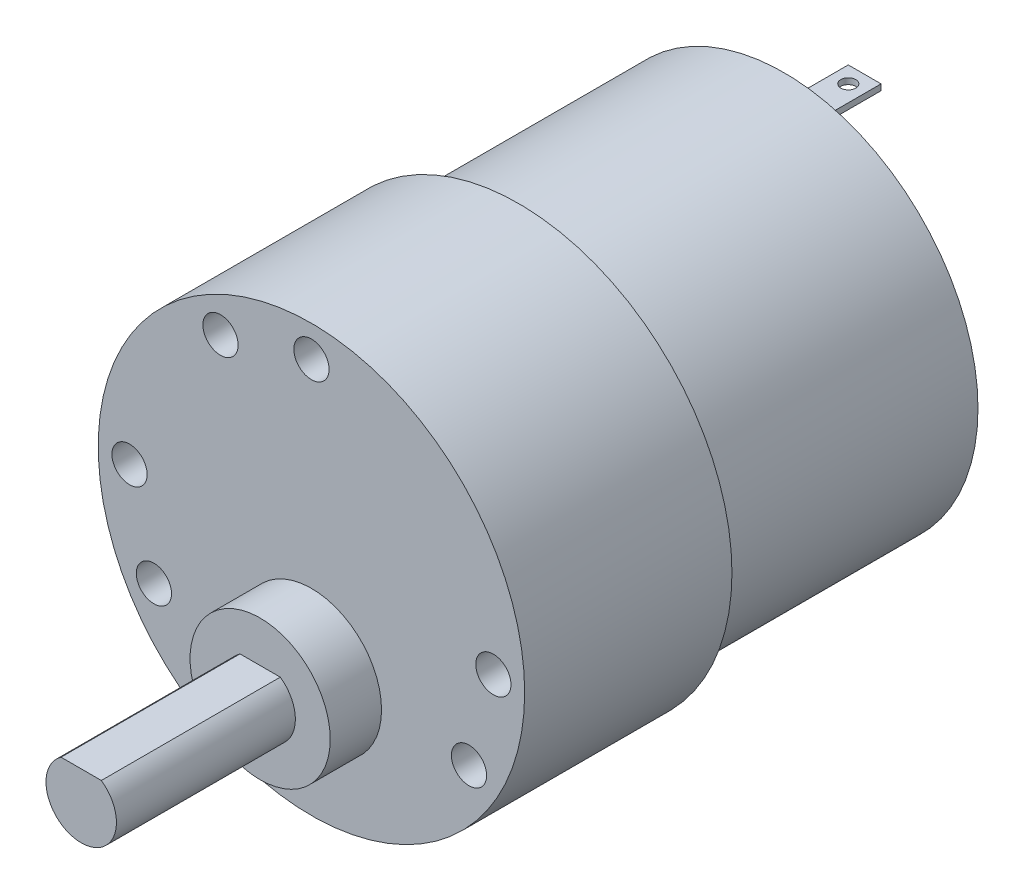
ISO-10303-21;
HEADER;
FILE_DESCRIPTION(('STEP AP214'),'2;1');
FILE_NAME('part.step','',(''),(''),'','','');
FILE_SCHEMA(('AUTOMOTIVE_DESIGN { 1 0 10303 214 1 1 1 1 }'));
ENDSEC;
DATA;
#1=APPLICATION_CONTEXT('core data for automotive mechanical design processes');
#2=APPLICATION_PROTOCOL_DEFINITION('international standard','automotive_design',2000,#1);
#3=PRODUCT_CONTEXT('',#1,'mechanical');
#4=PRODUCT('Part','Part','',(#3));
#5=PRODUCT_RELATED_PRODUCT_CATEGORY('part','',(#4));
#6=PRODUCT_DEFINITION_FORMATION('','',#4);
#7=PRODUCT_DEFINITION_CONTEXT('part definition',#1,'design');
#8=PRODUCT_DEFINITION('design','',#6,#7);
#9=PRODUCT_DEFINITION_SHAPE('','',#8);
#10=(LENGTH_UNIT() NAMED_UNIT(*) SI_UNIT(.MILLI.,.METRE.));
#11=(NAMED_UNIT(*) PLANE_ANGLE_UNIT() SI_UNIT($,.RADIAN.));
#12=(NAMED_UNIT(*) SI_UNIT($,.STERADIAN.) SOLID_ANGLE_UNIT());
#13=UNCERTAINTY_MEASURE_WITH_UNIT(LENGTH_MEASURE(1.E-05),#10,'distance_accuracy_value','');
#14=(GEOMETRIC_REPRESENTATION_CONTEXT(3) GLOBAL_UNCERTAINTY_ASSIGNED_CONTEXT((#13)) GLOBAL_UNIT_ASSIGNED_CONTEXT((#10,
#11,#12)) REPRESENTATION_CONTEXT('',''));
#15=CARTESIAN_POINT('',(0.,0.,0.));
#16=DIRECTION('',(0.,0.,1.));
#17=DIRECTION('',(1.,0.,0.));
#18=AXIS2_PLACEMENT_3D('',#15,#16,#17);
#19=CARTESIAN_POINT('',(0.,-12.7,-23.876));
#20=DIRECTION('',(0.,0.,-1.));
#21=DIRECTION('',(-1.,0.,0.));
#22=AXIS2_PLACEMENT_3D('',#19,#20,#21);
#23=PLANE('',#22);
#24=CARTESIAN_POINT('',(0.,-12.7,-23.876));
#25=DIRECTION('',(0.,0.,-1.));
#26=DIRECTION('',(-1.,0.,0.));
#27=AXIS2_PLACEMENT_3D('',#24,#25,#26);
#28=CIRCLE('',#27,2.413);
#29=CARTESIAN_POINT('',(-2.413,-12.7,-23.876));
#30=VERTEX_POINT('',#29);
#31=EDGE_CURVE('E277',#30,#30,#28,.T.);
#32=ORIENTED_EDGE('',*,*,#31,.T.);
#33=EDGE_LOOP('',(#32));
#34=FACE_BOUND('',#33,.T.);
#35=DIRECTION('',(-1.,0.,0.));
#36=VECTOR('',#35,1.);
#37=CARTESIAN_POINT('',(-1.397,-12.446,-23.876));
#38=LINE('',#37,#36);
#39=CARTESIAN_POINT('',(1.397,-12.446,-23.876));
#40=VERTEX_POINT('',#39);
#41=CARTESIAN_POINT('',(-1.397,-12.446,-23.876));
#42=VERTEX_POINT('',#41);
#43=EDGE_CURVE('E47',#40,#42,#38,.T.);
#44=ORIENTED_EDGE('',*,*,#43,.T.);
#45=DIRECTION('',(0.,1.,0.));
#46=VECTOR('',#45,1.);
#47=CARTESIAN_POINT('',(-1.397,-12.954,-23.876));
#48=LINE('',#47,#46);
#49=CARTESIAN_POINT('',(-1.397,-12.954,-23.876));
#50=VERTEX_POINT('',#49);
#51=EDGE_CURVE('E212',#50,#42,#48,.T.);
#52=ORIENTED_EDGE('',*,*,#51,.F.);
#53=DIRECTION('',(-1.,0.,0.));
#54=VECTOR('',#53,1.);
#55=CARTESIAN_POINT('',(-1.397,-12.954,-23.876));
#56=LINE('',#55,#54);
#57=CARTESIAN_POINT('',(1.397,-12.954,-23.876));
#58=VERTEX_POINT('',#57);
#59=EDGE_CURVE('E187',#58,#50,#56,.T.);
#60=ORIENTED_EDGE('',*,*,#59,.F.);
#61=DIRECTION('',(0.,1.,0.));
#62=VECTOR('',#61,1.);
#63=CARTESIAN_POINT('',(1.397,-12.954,-23.876));
#64=LINE('',#63,#62);
#65=EDGE_CURVE('E197',#58,#40,#64,.T.);
#66=ORIENTED_EDGE('',*,*,#65,.T.);
#67=EDGE_LOOP('',(#44,#52,#60,#66));
#68=FACE_BOUND('',#67,.T.);
#69=ADVANCED_FACE('F32',(#34,#68),#23,.T.);
#70=CARTESIAN_POINT('',(0.,12.7,-23.876));
#71=DIRECTION('',(0.,0.,-1.));
#72=DIRECTION('',(-1.,0.,0.));
#73=AXIS2_PLACEMENT_3D('',#70,#71,#72);
#74=PLANE('',#73);
#75=CARTESIAN_POINT('',(0.,12.7,-23.876));
#76=DIRECTION('',(0.,0.,-1.));
#77=DIRECTION('',(-1.,0.,0.));
#78=AXIS2_PLACEMENT_3D('',#75,#76,#77);
#79=CIRCLE('',#78,2.413);
#80=CARTESIAN_POINT('',(-2.413,12.7,-23.876));
#81=VERTEX_POINT('',#80);
#82=EDGE_CURVE('E271',#81,#81,#79,.T.);
#83=ORIENTED_EDGE('',*,*,#82,.T.);
#84=EDGE_LOOP('',(#83));
#85=FACE_BOUND('',#84,.T.);
#86=DIRECTION('',(1.,0.,0.));
#87=VECTOR('',#86,1.);
#88=CARTESIAN_POINT('',(1.397,12.446,-23.876));
#89=LINE('',#88,#87);
#90=CARTESIAN_POINT('',(-1.397,12.446,-23.876));
#91=VERTEX_POINT('',#90);
#92=CARTESIAN_POINT('',(1.397,12.446,-23.876));
#93=VERTEX_POINT('',#92);
#94=EDGE_CURVE('E55',#91,#93,#89,.T.);
#95=ORIENTED_EDGE('',*,*,#94,.T.);
#96=DIRECTION('',(0.,-1.,0.));
#97=VECTOR('',#96,1.);
#98=CARTESIAN_POINT('',(1.397,12.954,-23.876));
#99=LINE('',#98,#97);
#100=CARTESIAN_POINT('',(1.397,12.954,-23.876));
#101=VERTEX_POINT('',#100);
#102=EDGE_CURVE('E246',#101,#93,#99,.T.);
#103=ORIENTED_EDGE('',*,*,#102,.F.);
#104=DIRECTION('',(1.,0.,0.));
#105=VECTOR('',#104,1.);
#106=CARTESIAN_POINT('',(1.397,12.954,-23.876));
#107=LINE('',#106,#105);
#108=CARTESIAN_POINT('',(-1.397,12.954,-23.876));
#109=VERTEX_POINT('',#108);
#110=EDGE_CURVE('E221',#109,#101,#107,.T.);
#111=ORIENTED_EDGE('',*,*,#110,.F.);
#112=DIRECTION('',(0.,-1.,0.));
#113=VECTOR('',#112,1.);
#114=CARTESIAN_POINT('',(-1.397,12.954,-23.876));
#115=LINE('',#114,#113);
#116=EDGE_CURVE('E231',#109,#91,#115,.T.);
#117=ORIENTED_EDGE('',*,*,#116,.T.);
#118=EDGE_LOOP('',(#95,#103,#111,#117));
#119=FACE_BOUND('',#118,.T.);
#120=ADVANCED_FACE('F320',(#85,#119),#74,.T.);
#121=CARTESIAN_POINT('',(0.,-7.366,22.0218));
#122=DIRECTION('',(0.,0.,1.));
#123=DIRECTION('',(1.,0.,0.));
#124=AXIS2_PLACEMENT_3D('',#121,#122,#123);
#125=PLANE('',#124);
#126=CARTESIAN_POINT('',(0.,-7.366,22.0218));
#127=DIRECTION('',(0.,0.,1.));
#128=DIRECTION('',(1.,0.,0.));
#129=AXIS2_PLACEMENT_3D('',#126,#127,#128);
#130=CIRCLE('',#129,5.969);
#131=CARTESIAN_POINT('',(5.969,-7.366,22.0218));
#132=VERTEX_POINT('',#131);
#133=EDGE_CURVE('E265',#132,#132,#130,.T.);
#134=ORIENTED_EDGE('',*,*,#133,.T.);
#135=EDGE_LOOP('',(#134));
#136=FACE_BOUND('',#135,.T.);
#137=DIRECTION('',(-1.,0.,0.));
#138=VECTOR('',#137,1.);
#139=CARTESIAN_POINT('',(-1.71565701700544,-4.905,22.0218));
#140=LINE('',#139,#138);
#141=CARTESIAN_POINT('',(1.71565701700544,-4.905,22.0218));
#142=VERTEX_POINT('',#141);
#143=CARTESIAN_POINT('',(-1.71565701700544,-4.905,22.0218));
#144=VERTEX_POINT('',#143);
#145=EDGE_CURVE('E254',#142,#144,#140,.T.);
#146=ORIENTED_EDGE('',*,*,#145,.F.);
#147=CARTESIAN_POINT('',(0.,-7.366,22.0218));
#148=DIRECTION('',(0.,0.,1.));
#149=DIRECTION('',(1.,0.,0.));
#150=AXIS2_PLACEMENT_3D('',#147,#148,#149);
#151=CIRCLE('',#150,3.);
#152=EDGE_CURVE('E249',#144,#142,#151,.T.);
#153=ORIENTED_EDGE('',*,*,#152,.F.);
#154=EDGE_LOOP('',(#146,#153));
#155=FACE_BOUND('',#154,.T.);
#156=ADVANCED_FACE('F326',(#136,#155),#125,.T.);
#157=CARTESIAN_POINT('',(0.,0.,17.653));
#158=DIRECTION('',(0.,0.,1.));
#159=DIRECTION('',(1.,0.,0.));
#160=AXIS2_PLACEMENT_3D('',#157,#158,#159);
#161=PLANE('',#160);
#162=CARTESIAN_POINT('',(-7.74699999999983,13.4181976062362,17.653));
#163=DIRECTION('',(0.,0.,1.));
#164=DIRECTION('',(1.,0.,0.));
#165=AXIS2_PLACEMENT_3D('',#162,#163,#164);
#166=CIRCLE('',#165,1.49999999999999);
#167=CARTESIAN_POINT('',(-6.24699999999984,13.4181976062362,17.653));
#168=VERTEX_POINT('',#167);
#169=EDGE_CURVE('E141',#168,#168,#166,.T.);
#170=ORIENTED_EDGE('',*,*,#169,.F.);
#171=EDGE_LOOP('',(#170));
#172=FACE_BOUND('',#171,.T.);
#173=CARTESIAN_POINT('',(-15.494,1.62291035592107E-13,17.653));
#174=DIRECTION('',(0.,0.,1.));
#175=DIRECTION('',(1.,0.,0.));
#176=AXIS2_PLACEMENT_3D('',#173,#174,#175);
#177=CIRCLE('',#176,1.49999999999999);
#178=CARTESIAN_POINT('',(-13.994,1.62291035592107E-13,17.653));
#179=VERTEX_POINT('',#178);
#180=EDGE_CURVE('E140',#179,#179,#177,.T.);
#181=ORIENTED_EDGE('',*,*,#180,.F.);
#182=EDGE_LOOP('',(#181));
#183=FACE_BOUND('',#182,.T.);
#184=CARTESIAN_POINT('',(-13.4181976062362,-7.74699999999987,17.653));
#185=DIRECTION('',(0.,0.,1.));
#186=DIRECTION('',(1.,0.,0.));
#187=AXIS2_PLACEMENT_3D('',#184,#185,#186);
#188=CIRCLE('',#187,1.49999999999999);
#189=CARTESIAN_POINT('',(-11.9181976062362,-7.74699999999987,17.653));
#190=VERTEX_POINT('',#189);
#191=EDGE_CURVE('E151',#190,#190,#188,.T.);
#192=ORIENTED_EDGE('',*,*,#191,.F.);
#193=EDGE_LOOP('',(#192));
#194=FACE_BOUND('',#193,.T.);
#195=CARTESIAN_POINT('',(-7.74700000000011,-13.418197606236,17.653));
#196=DIRECTION('',(0.,0.,1.));
#197=DIRECTION('',(1.,0.,0.));
#198=AXIS2_PLACEMENT_3D('',#195,#196,#197);
#199=CIRCLE('',#198,1.49999999999999);
#200=CARTESIAN_POINT('',(-6.24700000000012,-13.418197606236,17.653));
#201=VERTEX_POINT('',#200);
#202=EDGE_CURVE('E157',#201,#201,#199,.T.);
#203=ORIENTED_EDGE('',*,*,#202,.F.);
#204=EDGE_LOOP('',(#203));
#205=FACE_BOUND('',#204,.T.);
#206=CARTESIAN_POINT('',(13.4181976062361,-7.74700000000006,17.653));
#207=DIRECTION('',(0.,0.,1.));
#208=DIRECTION('',(1.,0.,0.));
#209=AXIS2_PLACEMENT_3D('',#206,#207,#208);
#210=CIRCLE('',#209,1.49999999999999);
#211=CARTESIAN_POINT('',(14.918197606236,-7.74700000000006,17.653));
#212=VERTEX_POINT('',#211);
#213=EDGE_CURVE('E163',#212,#212,#210,.T.);
#214=ORIENTED_EDGE('',*,*,#213,.F.);
#215=EDGE_LOOP('',(#214));
#216=FACE_BOUND('',#215,.T.);
#217=CARTESIAN_POINT('',(15.494,0.,17.653));
#218=DIRECTION('',(0.,0.,1.));
#219=DIRECTION('',(1.,0.,0.));
#220=AXIS2_PLACEMENT_3D('',#217,#218,#219);
#221=CIRCLE('',#220,1.49999999999999);
#222=CARTESIAN_POINT('',(16.994,0.,17.653));
#223=VERTEX_POINT('',#222);
#224=EDGE_CURVE('E169',#223,#223,#221,.T.);
#225=ORIENTED_EDGE('',*,*,#224,.F.);
#226=EDGE_LOOP('',(#225));
#227=FACE_BOUND('',#226,.T.);
#228=CARTESIAN_POINT('',(0.,15.494,17.653));
#229=DIRECTION('',(0.,0.,1.));
#230=DIRECTION('',(1.,0.,0.));
#231=AXIS2_PLACEMENT_3D('',#228,#229,#230);
#232=CIRCLE('',#231,1.49999999999999);
#233=CARTESIAN_POINT('',(1.49999999999999,15.494,17.653));
#234=VERTEX_POINT('',#233);
#235=EDGE_CURVE('E175',#234,#234,#232,.T.);
#236=ORIENTED_EDGE('',*,*,#235,.F.);
#237=EDGE_LOOP('',(#236));
#238=FACE_BOUND('',#237,.T.);
#239=CARTESIAN_POINT('',(0.,0.,17.653));
#240=DIRECTION('',(0.,0.,1.));
#241=DIRECTION('',(1.,0.,0.));
#242=AXIS2_PLACEMENT_3D('',#239,#240,#241);
#243=CIRCLE('',#242,18.161);
#244=CARTESIAN_POINT('',(18.161,0.,17.653));
#245=VERTEX_POINT('',#244);
#246=EDGE_CURVE('E40',#245,#245,#243,.T.);
#247=ORIENTED_EDGE('',*,*,#246,.T.);
#248=EDGE_LOOP('',(#247));
#249=FACE_BOUND('',#248,.T.);
#250=CARTESIAN_POINT('',(0.,-7.366,17.653));
#251=DIRECTION('',(0.,0.,1.));
#252=DIRECTION('',(1.,0.,0.));
#253=AXIS2_PLACEMENT_3D('',#250,#251,#252);
#254=CIRCLE('',#253,5.969);
#255=CARTESIAN_POINT('',(5.969,-7.366,17.653));
#256=VERTEX_POINT('',#255);
#257=EDGE_CURVE('E264',#256,#256,#254,.T.);
#258=ORIENTED_EDGE('',*,*,#257,.F.);
#259=EDGE_LOOP('',(#258));
#260=FACE_BOUND('',#259,.T.);
#261=ADVANCED_FACE('F340',(#172,#183,#194,#205,#216,#227,#238,#249,#260),#161,.T.);
#262=CARTESIAN_POINT('',(0.,0.,-22.606));
#263=DIRECTION('',(0.,0.,-1.));
#264=DIRECTION('',(-1.,0.,0.));
#265=AXIS2_PLACEMENT_3D('',#262,#263,#264);
#266=PLANE('',#265);
#267=CARTESIAN_POINT('',(0.,-12.7,-22.606));
#268=DIRECTION('',(0.,0.,-1.));
#269=DIRECTION('',(-1.,0.,0.));
#270=AXIS2_PLACEMENT_3D('',#267,#268,#269);
#271=CIRCLE('',#270,2.413);
#272=CARTESIAN_POINT('',(-2.413,-12.7,-22.606));
#273=VERTEX_POINT('',#272);
#274=EDGE_CURVE('E274',#273,#273,#271,.T.);
#275=ORIENTED_EDGE('',*,*,#274,.F.);
#276=EDGE_LOOP('',(#275));
#277=FACE_BOUND('',#276,.T.);
#278=CARTESIAN_POINT('',(0.,0.,-22.606));
#279=DIRECTION('',(0.,0.,-1.));
#280=DIRECTION('',(-1.,0.,0.));
#281=AXIS2_PLACEMENT_3D('',#278,#279,#280);
#282=CIRCLE('',#281,16.51);
#283=CARTESIAN_POINT('',(-16.51,0.,-22.606));
#284=VERTEX_POINT('',#283);
#285=EDGE_CURVE('E286',#284,#284,#282,.T.);
#286=ORIENTED_EDGE('',*,*,#285,.T.);
#287=EDGE_LOOP('',(#286));
#288=FACE_BOUND('',#287,.T.);
#289=CARTESIAN_POINT('',(0.,0.,-22.606));
#290=DIRECTION('',(0.,0.,-1.));
#291=DIRECTION('',(-1.,0.,0.));
#292=AXIS2_PLACEMENT_3D('',#289,#290,#291);
#293=CIRCLE('',#292,4.5085);
#294=CARTESIAN_POINT('',(-4.5085,0.,-22.606));
#295=VERTEX_POINT('',#294);
#296=EDGE_CURVE('E280',#295,#295,#293,.T.);
#297=ORIENTED_EDGE('',*,*,#296,.F.);
#298=EDGE_LOOP('',(#297));
#299=FACE_BOUND('',#298,.T.);
#300=CARTESIAN_POINT('',(0.,12.7,-22.606));
#301=DIRECTION('',(0.,0.,-1.));
#302=DIRECTION('',(-1.,0.,0.));
#303=AXIS2_PLACEMENT_3D('',#300,#301,#302);
#304=CIRCLE('',#303,2.413);
#305=CARTESIAN_POINT('',(-2.413,12.7,-22.606));
#306=VERTEX_POINT('',#305);
#307=EDGE_CURVE('E268',#306,#306,#304,.T.);
#308=ORIENTED_EDGE('',*,*,#307,.F.);
#309=EDGE_LOOP('',(#308));
#310=FACE_BOUND('',#309,.T.);
#311=ADVANCED_FACE('F300',(#277,#288,#299,#310),#266,.T.);
#312=CARTESIAN_POINT('',(0.,0.,0.));
#313=DIRECTION('',(0.,0.,1.));
#314=DIRECTION('',(1.,0.,0.));
#315=AXIS2_PLACEMENT_3D('',#312,#313,#314);
#316=PLANE('',#315);
#317=CARTESIAN_POINT('',(0.,0.,0.));
#318=DIRECTION('',(0.,0.,1.));
#319=DIRECTION('',(1.,0.,0.));
#320=AXIS2_PLACEMENT_3D('',#317,#318,#319);
#321=CIRCLE('',#320,18.161);
#322=CARTESIAN_POINT('',(18.161,0.,0.));
#323=VERTEX_POINT('',#322);
#324=EDGE_CURVE('E291',#323,#323,#321,.T.);
#325=ORIENTED_EDGE('',*,*,#324,.F.);
#326=EDGE_LOOP('',(#325));
#327=FACE_BOUND('',#326,.T.);
#328=CARTESIAN_POINT('',(0.,0.,0.));
#329=DIRECTION('',(0.,0.,1.));
#330=DIRECTION('',(1.,0.,0.));
#331=AXIS2_PLACEMENT_3D('',#328,#329,#330);
#332=CIRCLE('',#331,16.51);
#333=CARTESIAN_POINT('',(16.51,0.,0.));
#334=VERTEX_POINT('',#333);
#335=EDGE_CURVE('E11',#334,#334,#332,.F.);
#336=ORIENTED_EDGE('',*,*,#335,.F.);
#337=EDGE_LOOP('',(#336));
#338=FACE_BOUND('',#337,.T.);
#339=ADVANCED_FACE('F297',(#327,#338),#316,.F.);
#340=CARTESIAN_POINT('',(0.,0.,17.653));
#341=DIRECTION('',(0.,0.,-1.));
#342=DIRECTION('',(-1.,0.,0.));
#343=AXIS2_PLACEMENT_3D('',#340,#341,#342);
#344=CYLINDRICAL_SURFACE('',#343,18.161);
#345=ORIENTED_EDGE('',*,*,#246,.F.);
#346=EDGE_LOOP('',(#345));
#347=FACE_BOUND('',#346,.T.);
#348=ORIENTED_EDGE('',*,*,#324,.T.);
#349=EDGE_LOOP('',(#348));
#350=FACE_BOUND('',#349,.T.);
#351=ADVANCED_FACE('F34',(#347,#350),#344,.T.);
#352=CARTESIAN_POINT('',(0.,0.,-22.606));
#353=DIRECTION('',(0.,0.,1.));
#354=DIRECTION('',(1.,0.,0.));
#355=AXIS2_PLACEMENT_3D('',#352,#353,#354);
#356=CYLINDRICAL_SURFACE('',#355,16.51);
#357=ORIENTED_EDGE('',*,*,#285,.F.);
#358=EDGE_LOOP('',(#357));
#359=FACE_BOUND('',#358,.T.);
#360=ORIENTED_EDGE('',*,*,#335,.T.);
#361=EDGE_LOOP('',(#360));
#362=FACE_BOUND('',#361,.T.);
#363=ADVANCED_FACE('F303',(#359,#362),#356,.T.);
#364=CARTESIAN_POINT('',(0.,0.,-25.908));
#365=DIRECTION('',(0.,0.,1.));
#366=DIRECTION('',(1.,0.,0.));
#367=AXIS2_PLACEMENT_3D('',#364,#365,#366);
#368=CYLINDRICAL_SURFACE('',#367,4.5085);
#369=CARTESIAN_POINT('',(0.,0.,-25.908));
#370=DIRECTION('',(0.,0.,-1.));
#371=DIRECTION('',(-1.,0.,0.));
#372=AXIS2_PLACEMENT_3D('',#369,#370,#371);
#373=CIRCLE('',#372,4.5085);
#374=CARTESIAN_POINT('',(-4.5085,0.,-25.908));
#375=VERTEX_POINT('',#374);
#376=EDGE_CURVE('E283',#375,#375,#373,.T.);
#377=ORIENTED_EDGE('',*,*,#376,.F.);
#378=EDGE_LOOP('',(#377));
#379=FACE_BOUND('',#378,.T.);
#380=ORIENTED_EDGE('',*,*,#296,.T.);
#381=EDGE_LOOP('',(#380));
#382=FACE_BOUND('',#381,.T.);
#383=ADVANCED_FACE('F305',(#379,#382),#368,.T.);
#384=CARTESIAN_POINT('',(0.,0.,-25.908));
#385=DIRECTION('',(0.,0.,-1.));
#386=DIRECTION('',(-1.,0.,0.));
#387=AXIS2_PLACEMENT_3D('',#384,#385,#386);
#388=PLANE('',#387);
#389=ORIENTED_EDGE('',*,*,#376,.T.);
#390=EDGE_LOOP('',(#389));
#391=FACE_BOUND('',#390,.T.);
#392=ADVANCED_FACE('F312',(#391),#388,.T.);
#393=CARTESIAN_POINT('',(0.,-12.7,-23.876));
#394=DIRECTION('',(0.,0.,1.));
#395=DIRECTION('',(1.,0.,0.));
#396=AXIS2_PLACEMENT_3D('',#393,#394,#395);
#397=CYLINDRICAL_SURFACE('',#396,2.413);
#398=ORIENTED_EDGE('',*,*,#31,.F.);
#399=EDGE_LOOP('',(#398));
#400=FACE_BOUND('',#399,.T.);
#401=ORIENTED_EDGE('',*,*,#274,.T.);
#402=EDGE_LOOP('',(#401));
#403=FACE_BOUND('',#402,.T.);
#404=ADVANCED_FACE('F333',(#400,#403),#397,.T.);
#405=CARTESIAN_POINT('',(0.,12.7,-23.876));
#406=DIRECTION('',(0.,0.,1.));
#407=DIRECTION('',(1.,0.,0.));
#408=AXIS2_PLACEMENT_3D('',#405,#406,#407);
#409=CYLINDRICAL_SURFACE('',#408,2.413);
#410=ORIENTED_EDGE('',*,*,#82,.F.);
#411=EDGE_LOOP('',(#410));
#412=FACE_BOUND('',#411,.T.);
#413=ORIENTED_EDGE('',*,*,#307,.T.);
#414=EDGE_LOOP('',(#413));
#415=FACE_BOUND('',#414,.T.);
#416=ADVANCED_FACE('F332',(#412,#415),#409,.T.);
#417=CARTESIAN_POINT('',(0.,-7.366,22.0218));
#418=DIRECTION('',(0.,0.,-1.));
#419=DIRECTION('',(-1.,0.,0.));
#420=AXIS2_PLACEMENT_3D('',#417,#418,#419);
#421=CYLINDRICAL_SURFACE('',#420,5.969);
#422=ORIENTED_EDGE('',*,*,#133,.F.);
#423=EDGE_LOOP('',(#422));
#424=FACE_BOUND('',#423,.T.);
#425=ORIENTED_EDGE('',*,*,#257,.T.);
#426=EDGE_LOOP('',(#425));
#427=FACE_BOUND('',#426,.T.);
#428=ADVANCED_FACE('F354',(#424,#427),#421,.T.);
#429=CARTESIAN_POINT('',(0.,-7.366,37.2618));
#430=DIRECTION('',(0.,0.,-1.));
#431=DIRECTION('',(-1.,0.,0.));
#432=AXIS2_PLACEMENT_3D('',#429,#430,#431);
#433=CYLINDRICAL_SURFACE('',#432,3.);
#434=ORIENTED_EDGE('',*,*,#152,.T.);
#435=DIRECTION('',(0.,0.,-1.));
#436=VECTOR('',#435,1.);
#437=CARTESIAN_POINT('',(1.71565701700544,-4.905,37.2618));
#438=LINE('',#437,#436);
#439=CARTESIAN_POINT('',(1.71565701700544,-4.905,37.2618));
#440=VERTEX_POINT('',#439);
#441=EDGE_CURVE('E261',#440,#142,#438,.T.);
#442=ORIENTED_EDGE('',*,*,#441,.F.);
#443=CARTESIAN_POINT('',(0.,-7.366,37.2618));
#444=DIRECTION('',(0.,0.,1.));
#445=DIRECTION('',(1.,0.,0.));
#446=AXIS2_PLACEMENT_3D('',#443,#444,#445);
#447=CIRCLE('',#446,3.);
#448=CARTESIAN_POINT('',(-1.71565701700544,-4.905,37.2618));
#449=VERTEX_POINT('',#448);
#450=EDGE_CURVE('E250',#449,#440,#447,.T.);
#451=ORIENTED_EDGE('',*,*,#450,.F.);
#452=DIRECTION('',(0.,0.,-1.));
#453=VECTOR('',#452,1.);
#454=CARTESIAN_POINT('',(-1.71565701700544,-4.905,37.2618));
#455=LINE('',#454,#453);
#456=EDGE_CURVE('E256',#449,#144,#455,.T.);
#457=ORIENTED_EDGE('',*,*,#456,.T.);
#458=EDGE_LOOP('',(#434,#442,#451,#457));
#459=FACE_BOUND('',#458,.T.);
#460=ADVANCED_FACE('F359',(#459),#433,.T.);
#461=CARTESIAN_POINT('',(-1.71565701700544,-4.905,37.2618));
#462=DIRECTION('',(0.,-1.,0.));
#463=DIRECTION('',(0.,0.,-1.));
#464=AXIS2_PLACEMENT_3D('',#461,#462,#463);
#465=PLANE('',#464);
#466=ORIENTED_EDGE('',*,*,#145,.T.);
#467=ORIENTED_EDGE('',*,*,#456,.F.);
#468=DIRECTION('',(-1.,0.,0.));
#469=VECTOR('',#468,1.);
#470=CARTESIAN_POINT('',(-1.71565701700544,-4.905,37.2618));
#471=LINE('',#470,#469);
#472=EDGE_CURVE('E253',#440,#449,#471,.T.);
#473=ORIENTED_EDGE('',*,*,#472,.F.);
#474=ORIENTED_EDGE('',*,*,#441,.T.);
#475=EDGE_LOOP('',(#466,#467,#473,#474));
#476=FACE_BOUND('',#475,.T.);
#477=ADVANCED_FACE('F407',(#476),#465,.F.);
#478=CARTESIAN_POINT('',(0.,-7.366,37.2618));
#479=DIRECTION('',(0.,0.,1.));
#480=DIRECTION('',(1.,0.,0.));
#481=AXIS2_PLACEMENT_3D('',#478,#479,#480);
#482=PLANE('',#481);
#483=ORIENTED_EDGE('',*,*,#450,.T.);
#484=ORIENTED_EDGE('',*,*,#472,.T.);
#485=EDGE_LOOP('',(#483,#484));
#486=FACE_BOUND('',#485,.T.);
#487=ADVANCED_FACE('F384',(#486),#482,.T.);
#488=CARTESIAN_POINT('',(0.,12.954,0.));
#489=DIRECTION('',(0.,-1.,0.));
#490=DIRECTION('',(0.,0.,-1.));
#491=AXIS2_PLACEMENT_3D('',#488,#489,#490);
#492=PLANE('',#491);
#493=ORIENTED_EDGE('',*,*,#110,.T.);
#494=DIRECTION('',(0.,0.,-1.));
#495=VECTOR('',#494,1.);
#496=CARTESIAN_POINT('',(1.397,12.954,-23.876));
#497=LINE('',#496,#495);
#498=CARTESIAN_POINT('',(1.397,12.954,-29.464));
#499=VERTEX_POINT('',#498);
#500=EDGE_CURVE('E224',#101,#499,#497,.T.);
#501=ORIENTED_EDGE('',*,*,#500,.T.);
#502=DIRECTION('',(-1.,0.,0.));
#503=VECTOR('',#502,1.);
#504=CARTESIAN_POINT('',(1.397,12.954,-29.464));
#505=LINE('',#504,#503);
#506=CARTESIAN_POINT('',(-1.397,12.954,-29.464));
#507=VERTEX_POINT('',#506);
#508=EDGE_CURVE('E227',#499,#507,#505,.T.);
#509=ORIENTED_EDGE('',*,*,#508,.T.);
#510=DIRECTION('',(0.,0.,1.));
#511=VECTOR('',#510,1.);
#512=CARTESIAN_POINT('',(-1.397,12.954,-23.876));
#513=LINE('',#512,#511);
#514=EDGE_CURVE('E229',#507,#109,#513,.T.);
#515=ORIENTED_EDGE('',*,*,#514,.T.);
#516=EDGE_LOOP('',(#493,#501,#509,#515));
#517=FACE_BOUND('',#516,.T.);
#518=CARTESIAN_POINT('',(0.,12.954,-28.067));
#519=DIRECTION('',(0.,1.,0.));
#520=DIRECTION('',(0.,0.,1.));
#521=AXIS2_PLACEMENT_3D('',#518,#519,#520);
#522=CIRCLE('',#521,0.634999999999999);
#523=CARTESIAN_POINT('',(0.,12.954,-27.432));
#524=VERTEX_POINT('',#523);
#525=EDGE_CURVE('E216',#524,#524,#522,.T.);
#526=ORIENTED_EDGE('',*,*,#525,.F.);
#527=EDGE_LOOP('',(#526));
#528=FACE_BOUND('',#527,.T.);
#529=ADVANCED_FACE('F381',(#517,#528),#492,.F.);
#530=CARTESIAN_POINT('',(0.,12.446,0.));
#531=DIRECTION('',(0.,-1.,0.));
#532=DIRECTION('',(0.,0.,-1.));
#533=AXIS2_PLACEMENT_3D('',#530,#531,#532);
#534=PLANE('',#533);
#535=ORIENTED_EDGE('',*,*,#94,.F.);
#536=DIRECTION('',(0.,0.,1.));
#537=VECTOR('',#536,1.);
#538=CARTESIAN_POINT('',(-1.397,12.446,-23.876));
#539=LINE('',#538,#537);
#540=CARTESIAN_POINT('',(-1.397,12.446,-29.464));
#541=VERTEX_POINT('',#540);
#542=EDGE_CURVE('E225',#541,#91,#539,.T.);
#543=ORIENTED_EDGE('',*,*,#542,.F.);
#544=DIRECTION('',(-1.,0.,0.));
#545=VECTOR('',#544,1.);
#546=CARTESIAN_POINT('',(1.397,12.446,-29.464));
#547=LINE('',#546,#545);
#548=CARTESIAN_POINT('',(1.397,12.446,-29.464));
#549=VERTEX_POINT('',#548);
#550=EDGE_CURVE('E235',#549,#541,#547,.T.);
#551=ORIENTED_EDGE('',*,*,#550,.F.);
#552=DIRECTION('',(0.,0.,-1.));
#553=VECTOR('',#552,1.);
#554=CARTESIAN_POINT('',(1.397,12.446,-23.876));
#555=LINE('',#554,#553);
#556=EDGE_CURVE('E233',#93,#549,#555,.T.);
#557=ORIENTED_EDGE('',*,*,#556,.F.);
#558=EDGE_LOOP('',(#535,#543,#551,#557));
#559=FACE_BOUND('',#558,.T.);
#560=CARTESIAN_POINT('',(0.,12.446,-28.067));
#561=DIRECTION('',(0.,1.,0.));
#562=DIRECTION('',(0.,0.,1.));
#563=AXIS2_PLACEMENT_3D('',#560,#561,#562);
#564=CIRCLE('',#563,0.634999999999999);
#565=CARTESIAN_POINT('',(0.,12.446,-27.432));
#566=VERTEX_POINT('',#565);
#567=EDGE_CURVE('E215',#566,#566,#564,.T.);
#568=ORIENTED_EDGE('',*,*,#567,.T.);
#569=EDGE_LOOP('',(#568));
#570=FACE_BOUND('',#569,.T.);
#571=ADVANCED_FACE('F372',(#559,#570),#534,.T.);
#572=CARTESIAN_POINT('',(1.397,12.954,-23.876));
#573=DIRECTION('',(-1.,0.,0.));
#574=DIRECTION('',(0.,0.,1.));
#575=AXIS2_PLACEMENT_3D('',#572,#573,#574);
#576=PLANE('',#575);
#577=ORIENTED_EDGE('',*,*,#556,.T.);
#578=DIRECTION('',(0.,-1.,0.));
#579=VECTOR('',#578,1.);
#580=CARTESIAN_POINT('',(1.397,12.954,-29.464));
#581=LINE('',#580,#579);
#582=EDGE_CURVE('E243',#499,#549,#581,.T.);
#583=ORIENTED_EDGE('',*,*,#582,.F.);
#584=ORIENTED_EDGE('',*,*,#500,.F.);
#585=ORIENTED_EDGE('',*,*,#102,.T.);
#586=EDGE_LOOP('',(#577,#583,#584,#585));
#587=FACE_BOUND('',#586,.T.);
#588=ADVANCED_FACE('F379',(#587),#576,.F.);
#589=CARTESIAN_POINT('',(1.397,12.954,-29.464));
#590=DIRECTION('',(0.,0.,1.));
#591=DIRECTION('',(1.,0.,0.));
#592=AXIS2_PLACEMENT_3D('',#589,#590,#591);
#593=PLANE('',#592);
#594=ORIENTED_EDGE('',*,*,#550,.T.);
#595=DIRECTION('',(0.,-1.,0.));
#596=VECTOR('',#595,1.);
#597=CARTESIAN_POINT('',(-1.397,12.954,-29.464));
#598=LINE('',#597,#596);
#599=EDGE_CURVE('E240',#507,#541,#598,.T.);
#600=ORIENTED_EDGE('',*,*,#599,.F.);
#601=ORIENTED_EDGE('',*,*,#508,.F.);
#602=ORIENTED_EDGE('',*,*,#582,.T.);
#603=EDGE_LOOP('',(#594,#600,#601,#602));
#604=FACE_BOUND('',#603,.T.);
#605=ADVANCED_FACE('F375',(#604),#593,.F.);
#606=CARTESIAN_POINT('',(-1.397,12.954,-23.876));
#607=DIRECTION('',(1.,0.,0.));
#608=DIRECTION('',(0.,0.,-1.));
#609=AXIS2_PLACEMENT_3D('',#606,#607,#608);
#610=PLANE('',#609);
#611=ORIENTED_EDGE('',*,*,#542,.T.);
#612=ORIENTED_EDGE('',*,*,#116,.F.);
#613=ORIENTED_EDGE('',*,*,#514,.F.);
#614=ORIENTED_EDGE('',*,*,#599,.T.);
#615=EDGE_LOOP('',(#611,#612,#613,#614));
#616=FACE_BOUND('',#615,.T.);
#617=ADVANCED_FACE('F369',(#616),#610,.F.);
#618=CARTESIAN_POINT('',(0.,12.954,-28.067));
#619=DIRECTION('',(0.,-1.,0.));
#620=DIRECTION('',(0.,0.,-1.));
#621=AXIS2_PLACEMENT_3D('',#618,#619,#620);
#622=CYLINDRICAL_SURFACE('',#621,0.634999999999999);
#623=ORIENTED_EDGE('',*,*,#525,.T.);
#624=EDGE_LOOP('',(#623));
#625=FACE_BOUND('',#624,.T.);
#626=ORIENTED_EDGE('',*,*,#567,.F.);
#627=EDGE_LOOP('',(#626));
#628=FACE_BOUND('',#627,.T.);
#629=ADVANCED_FACE('F388',(#625,#628),#622,.F.);
#630=CARTESIAN_POINT('',(0.,-12.954,0.));
#631=DIRECTION('',(0.,1.,0.));
#632=DIRECTION('',(0.,0.,-1.));
#633=AXIS2_PLACEMENT_3D('',#630,#631,#632);
#634=PLANE('',#633);
#635=ORIENTED_EDGE('',*,*,#59,.T.);
#636=DIRECTION('',(0.,0.,-1.));
#637=VECTOR('',#636,1.);
#638=CARTESIAN_POINT('',(-1.397,-12.954,-23.876));
#639=LINE('',#638,#637);
#640=CARTESIAN_POINT('',(-1.397,-12.954,-29.464));
#641=VERTEX_POINT('',#640);
#642=EDGE_CURVE('E190',#50,#641,#639,.T.);
#643=ORIENTED_EDGE('',*,*,#642,.T.);
#644=DIRECTION('',(1.,0.,0.));
#645=VECTOR('',#644,1.);
#646=CARTESIAN_POINT('',(-1.397,-12.954,-29.464));
#647=LINE('',#646,#645);
#648=CARTESIAN_POINT('',(1.397,-12.954,-29.464));
#649=VERTEX_POINT('',#648);
#650=EDGE_CURVE('E193',#641,#649,#647,.T.);
#651=ORIENTED_EDGE('',*,*,#650,.T.);
#652=DIRECTION('',(0.,0.,1.));
#653=VECTOR('',#652,1.);
#654=CARTESIAN_POINT('',(1.397,-12.954,-23.876));
#655=LINE('',#654,#653);
#656=EDGE_CURVE('E195',#649,#58,#655,.T.);
#657=ORIENTED_EDGE('',*,*,#656,.T.);
#658=EDGE_LOOP('',(#635,#643,#651,#657));
#659=FACE_BOUND('',#658,.T.);
#660=CARTESIAN_POINT('',(0.,-12.954,-28.067));
#661=DIRECTION('',(0.,-1.,0.));
#662=DIRECTION('',(0.,0.,1.));
#663=AXIS2_PLACEMENT_3D('',#660,#661,#662);
#664=CIRCLE('',#663,0.634999999999999);
#665=CARTESIAN_POINT('',(0.,-12.954,-27.432));
#666=VERTEX_POINT('',#665);
#667=EDGE_CURVE('E182',#666,#666,#664,.T.);
#668=ORIENTED_EDGE('',*,*,#667,.F.);
#669=EDGE_LOOP('',(#668));
#670=FACE_BOUND('',#669,.T.);
#671=ADVANCED_FACE('F391',(#659,#670),#634,.F.);
#672=CARTESIAN_POINT('',(0.,-12.446,0.));
#673=DIRECTION('',(0.,1.,0.));
#674=DIRECTION('',(0.,0.,-1.));
#675=AXIS2_PLACEMENT_3D('',#672,#673,#674);
#676=PLANE('',#675);
#677=ORIENTED_EDGE('',*,*,#43,.F.);
#678=DIRECTION('',(0.,0.,1.));
#679=VECTOR('',#678,1.);
#680=CARTESIAN_POINT('',(1.397,-12.446,-23.876));
#681=LINE('',#680,#679);
#682=CARTESIAN_POINT('',(1.397,-12.446,-29.464));
#683=VERTEX_POINT('',#682);
#684=EDGE_CURVE('E191',#683,#40,#681,.T.);
#685=ORIENTED_EDGE('',*,*,#684,.F.);
#686=DIRECTION('',(1.,0.,0.));
#687=VECTOR('',#686,1.);
#688=CARTESIAN_POINT('',(-1.397,-12.446,-29.464));
#689=LINE('',#688,#687);
#690=CARTESIAN_POINT('',(-1.397,-12.446,-29.464));
#691=VERTEX_POINT('',#690);
#692=EDGE_CURVE('E201',#691,#683,#689,.T.);
#693=ORIENTED_EDGE('',*,*,#692,.F.);
#694=DIRECTION('',(0.,0.,-1.));
#695=VECTOR('',#694,1.);
#696=CARTESIAN_POINT('',(-1.397,-12.446,-23.876));
#697=LINE('',#696,#695);
#698=EDGE_CURVE('E199',#42,#691,#697,.T.);
#699=ORIENTED_EDGE('',*,*,#698,.F.);
#700=EDGE_LOOP('',(#677,#685,#693,#699));
#701=FACE_BOUND('',#700,.T.);
#702=CARTESIAN_POINT('',(0.,-12.446,-28.067));
#703=DIRECTION('',(0.,-1.,0.));
#704=DIRECTION('',(0.,0.,1.));
#705=AXIS2_PLACEMENT_3D('',#702,#703,#704);
#706=CIRCLE('',#705,0.634999999999999);
#707=CARTESIAN_POINT('',(0.,-12.446,-27.432));
#708=VERTEX_POINT('',#707);
#709=EDGE_CURVE('E181',#708,#708,#706,.T.);
#710=ORIENTED_EDGE('',*,*,#709,.T.);
#711=EDGE_LOOP('',(#710));
#712=FACE_BOUND('',#711,.T.);
#713=ADVANCED_FACE('F577',(#701,#712),#676,.T.);
#714=CARTESIAN_POINT('',(-1.397,-12.954,-23.876));
#715=DIRECTION('',(1.,0.,0.));
#716=DIRECTION('',(0.,0.,-1.));
#717=AXIS2_PLACEMENT_3D('',#714,#715,#716);
#718=PLANE('',#717);
#719=ORIENTED_EDGE('',*,*,#698,.T.);
#720=DIRECTION('',(0.,1.,0.));
#721=VECTOR('',#720,1.);
#722=CARTESIAN_POINT('',(-1.397,-12.954,-29.464));
#723=LINE('',#722,#721);
#724=EDGE_CURVE('E209',#641,#691,#723,.T.);
#725=ORIENTED_EDGE('',*,*,#724,.F.);
#726=ORIENTED_EDGE('',*,*,#642,.F.);
#727=ORIENTED_EDGE('',*,*,#51,.T.);
#728=EDGE_LOOP('',(#719,#725,#726,#727));
#729=FACE_BOUND('',#728,.T.);
#730=ADVANCED_FACE('F581',(#729),#718,.F.);
#731=CARTESIAN_POINT('',(-1.397,-12.954,-29.464));
#732=DIRECTION('',(0.,0.,1.));
#733=DIRECTION('',(1.,0.,0.));
#734=AXIS2_PLACEMENT_3D('',#731,#732,#733);
#735=PLANE('',#734);
#736=ORIENTED_EDGE('',*,*,#692,.T.);
#737=DIRECTION('',(0.,1.,0.));
#738=VECTOR('',#737,1.);
#739=CARTESIAN_POINT('',(1.397,-12.954,-29.464));
#740=LINE('',#739,#738);
#741=EDGE_CURVE('E206',#649,#683,#740,.T.);
#742=ORIENTED_EDGE('',*,*,#741,.F.);
#743=ORIENTED_EDGE('',*,*,#650,.F.);
#744=ORIENTED_EDGE('',*,*,#724,.T.);
#745=EDGE_LOOP('',(#736,#742,#743,#744));
#746=FACE_BOUND('',#745,.T.);
#747=ADVANCED_FACE('F584',(#746),#735,.F.);
#748=CARTESIAN_POINT('',(1.397,-12.954,-23.876));
#749=DIRECTION('',(-1.,0.,0.));
#750=DIRECTION('',(0.,0.,1.));
#751=AXIS2_PLACEMENT_3D('',#748,#749,#750);
#752=PLANE('',#751);
#753=ORIENTED_EDGE('',*,*,#684,.T.);
#754=ORIENTED_EDGE('',*,*,#65,.F.);
#755=ORIENTED_EDGE('',*,*,#656,.F.);
#756=ORIENTED_EDGE('',*,*,#741,.T.);
#757=EDGE_LOOP('',(#753,#754,#755,#756));
#758=FACE_BOUND('',#757,.T.);
#759=ADVANCED_FACE('F573',(#758),#752,.F.);
#760=CARTESIAN_POINT('',(0.,-12.954,-28.067));
#761=DIRECTION('',(0.,1.,0.));
#762=DIRECTION('',(0.,0.,1.));
#763=AXIS2_PLACEMENT_3D('',#760,#761,#762);
#764=CYLINDRICAL_SURFACE('',#763,0.634999999999999);
#765=ORIENTED_EDGE('',*,*,#667,.T.);
#766=EDGE_LOOP('',(#765));
#767=FACE_BOUND('',#766,.T.);
#768=ORIENTED_EDGE('',*,*,#709,.F.);
#769=EDGE_LOOP('',(#768));
#770=FACE_BOUND('',#769,.T.);
#771=ADVANCED_FACE('F569',(#767,#770),#764,.F.);
#772=CARTESIAN_POINT('',(0.,15.494,7.493));
#773=DIRECTION('',(0.,0.,1.));
#774=DIRECTION('',(1.,0.,0.));
#775=AXIS2_PLACEMENT_3D('',#772,#773,#774);
#776=CONICAL_SURFACE('',#775,1.49999999999999,1.02974425867665);
#777=CARTESIAN_POINT('',(0.,15.494,6.59170907145866));
#778=VERTEX_POINT('',#777);
#779=VERTEX_LOOP('',#778);
#780=FACE_BOUND('',#779,.T.);
#781=CARTESIAN_POINT('',(0.,15.494,7.493));
#782=DIRECTION('',(0.,0.,1.));
#783=DIRECTION('',(1.,0.,0.));
#784=AXIS2_PLACEMENT_3D('',#781,#782,#783);
#785=CIRCLE('',#784,1.49999999999999);
#786=CARTESIAN_POINT('',(1.49999999999999,15.494,7.493));
#787=VERTEX_POINT('',#786);
#788=EDGE_CURVE('E178',#787,#787,#785,.T.);
#789=ORIENTED_EDGE('',*,*,#788,.T.);
#790=EDGE_LOOP('',(#789));
#791=FACE_BOUND('',#790,.T.);
#792=ADVANCED_FACE('F565',(#780,#791),#776,.F.);
#793=CARTESIAN_POINT('',(0.,15.494,17.653));
#794=DIRECTION('',(0.,0.,1.));
#795=DIRECTION('',(1.,0.,0.));
#796=AXIS2_PLACEMENT_3D('',#793,#794,#795);
#797=CYLINDRICAL_SURFACE('',#796,1.49999999999999);
#798=ORIENTED_EDGE('',*,*,#788,.F.);
#799=EDGE_LOOP('',(#798));
#800=FACE_BOUND('',#799,.T.);
#801=ORIENTED_EDGE('',*,*,#235,.T.);
#802=EDGE_LOOP('',(#801));
#803=FACE_BOUND('',#802,.T.);
#804=ADVANCED_FACE('F445',(#800,#803),#797,.F.);
#805=CARTESIAN_POINT('',(15.494,0.,7.493));
#806=DIRECTION('',(0.,0.,1.));
#807=DIRECTION('',(1.,0.,0.));
#808=AXIS2_PLACEMENT_3D('',#805,#806,#807);
#809=CONICAL_SURFACE('',#808,1.49999999999999,1.02974425867665);
#810=CARTESIAN_POINT('',(15.494,0.,6.59170907145866));
#811=VERTEX_POINT('',#810);
#812=VERTEX_LOOP('',#811);
#813=FACE_BOUND('',#812,.T.);
#814=CARTESIAN_POINT('',(15.494,0.,7.493));
#815=DIRECTION('',(0.,0.,1.));
#816=DIRECTION('',(1.,0.,0.));
#817=AXIS2_PLACEMENT_3D('',#814,#815,#816);
#818=CIRCLE('',#817,1.49999999999999);
#819=CARTESIAN_POINT('',(16.994,0.,7.493));
#820=VERTEX_POINT('',#819);
#821=EDGE_CURVE('E172',#820,#820,#818,.T.);
#822=ORIENTED_EDGE('',*,*,#821,.T.);
#823=EDGE_LOOP('',(#822));
#824=FACE_BOUND('',#823,.T.);
#825=ADVANCED_FACE('F450',(#813,#824),#809,.F.);
#826=CARTESIAN_POINT('',(15.494,0.,17.653));
#827=DIRECTION('',(0.,0.,1.));
#828=DIRECTION('',(1.,0.,0.));
#829=AXIS2_PLACEMENT_3D('',#826,#827,#828);
#830=CYLINDRICAL_SURFACE('',#829,1.49999999999999);
#831=ORIENTED_EDGE('',*,*,#821,.F.);
#832=EDGE_LOOP('',(#831));
#833=FACE_BOUND('',#832,.T.);
#834=ORIENTED_EDGE('',*,*,#224,.T.);
#835=EDGE_LOOP('',(#834));
#836=FACE_BOUND('',#835,.T.);
#837=ADVANCED_FACE('F455',(#833,#836),#830,.F.);
#838=CARTESIAN_POINT('',(13.4181976062361,-7.74700000000006,7.493));
#839=DIRECTION('',(0.,0.,1.));
#840=DIRECTION('',(1.,0.,0.));
#841=AXIS2_PLACEMENT_3D('',#838,#839,#840);
#842=CONICAL_SURFACE('',#841,1.49999999999999,1.02974425867665);
#843=CARTESIAN_POINT('',(13.4181976062361,-7.74700000000006,6.59170907145866));
#844=VERTEX_POINT('',#843);
#845=VERTEX_LOOP('',#844);
#846=FACE_BOUND('',#845,.T.);
#847=CARTESIAN_POINT('',(13.4181976062361,-7.74700000000006,7.493));
#848=DIRECTION('',(0.,0.,1.));
#849=DIRECTION('',(1.,0.,0.));
#850=AXIS2_PLACEMENT_3D('',#847,#848,#849);
#851=CIRCLE('',#850,1.49999999999999);
#852=CARTESIAN_POINT('',(14.918197606236,-7.74700000000006,7.493));
#853=VERTEX_POINT('',#852);
#854=EDGE_CURVE('E166',#853,#853,#851,.T.);
#855=ORIENTED_EDGE('',*,*,#854,.T.);
#856=EDGE_LOOP('',(#855));
#857=FACE_BOUND('',#856,.T.);
#858=ADVANCED_FACE('F465',(#846,#857),#842,.F.);
#859=CARTESIAN_POINT('',(13.4181976062361,-7.74700000000006,17.653));
#860=DIRECTION('',(0.,0.,1.));
#861=DIRECTION('',(1.,0.,0.));
#862=AXIS2_PLACEMENT_3D('',#859,#860,#861);
#863=CYLINDRICAL_SURFACE('',#862,1.49999999999999);
#864=ORIENTED_EDGE('',*,*,#854,.F.);
#865=EDGE_LOOP('',(#864));
#866=FACE_BOUND('',#865,.T.);
#867=ORIENTED_EDGE('',*,*,#213,.T.);
#868=EDGE_LOOP('',(#867));
#869=FACE_BOUND('',#868,.T.);
#870=ADVANCED_FACE('F475',(#866,#869),#863,.F.);
#871=CARTESIAN_POINT('',(-7.74700000000011,-13.418197606236,7.493));
#872=DIRECTION('',(0.,0.,1.));
#873=DIRECTION('',(1.,0.,0.));
#874=AXIS2_PLACEMENT_3D('',#871,#872,#873);
#875=CONICAL_SURFACE('',#874,1.49999999999999,1.02974425867665);
#876=CARTESIAN_POINT('',(-7.74700000000011,-13.418197606236,6.59170907145866));
#877=VERTEX_POINT('',#876);
#878=VERTEX_LOOP('',#877);
#879=FACE_BOUND('',#878,.T.);
#880=CARTESIAN_POINT('',(-7.74700000000011,-13.418197606236,7.493));
#881=DIRECTION('',(0.,0.,1.));
#882=DIRECTION('',(1.,0.,0.));
#883=AXIS2_PLACEMENT_3D('',#880,#881,#882);
#884=CIRCLE('',#883,1.49999999999999);
#885=CARTESIAN_POINT('',(-6.24700000000012,-13.418197606236,7.493));
#886=VERTEX_POINT('',#885);
#887=EDGE_CURVE('E160',#886,#886,#884,.T.);
#888=ORIENTED_EDGE('',*,*,#887,.T.);
#889=EDGE_LOOP('',(#888));
#890=FACE_BOUND('',#889,.T.);
#891=ADVANCED_FACE('F485',(#879,#890),#875,.F.);
#892=CARTESIAN_POINT('',(-7.74700000000011,-13.418197606236,17.653));
#893=DIRECTION('',(0.,0.,1.));
#894=DIRECTION('',(1.,0.,0.));
#895=AXIS2_PLACEMENT_3D('',#892,#893,#894);
#896=CYLINDRICAL_SURFACE('',#895,1.49999999999999);
#897=ORIENTED_EDGE('',*,*,#887,.F.);
#898=EDGE_LOOP('',(#897));
#899=FACE_BOUND('',#898,.T.);
#900=ORIENTED_EDGE('',*,*,#202,.T.);
#901=EDGE_LOOP('',(#900));
#902=FACE_BOUND('',#901,.T.);
#903=ADVANCED_FACE('F495',(#899,#902),#896,.F.);
#904=CARTESIAN_POINT('',(-13.4181976062362,-7.74699999999987,7.493));
#905=DIRECTION('',(0.,0.,1.));
#906=DIRECTION('',(1.,0.,0.));
#907=AXIS2_PLACEMENT_3D('',#904,#905,#906);
#908=CONICAL_SURFACE('',#907,1.49999999999999,1.02974425867665);
#909=CARTESIAN_POINT('',(-13.4181976062362,-7.74699999999987,6.59170907145866));
#910=VERTEX_POINT('',#909);
#911=VERTEX_LOOP('',#910);
#912=FACE_BOUND('',#911,.T.);
#913=CARTESIAN_POINT('',(-13.4181976062362,-7.74699999999987,7.493));
#914=DIRECTION('',(0.,0.,1.));
#915=DIRECTION('',(1.,0.,0.));
#916=AXIS2_PLACEMENT_3D('',#913,#914,#915);
#917=CIRCLE('',#916,1.49999999999999);
#918=CARTESIAN_POINT('',(-11.9181976062362,-7.74699999999987,7.493));
#919=VERTEX_POINT('',#918);
#920=EDGE_CURVE('E154',#919,#919,#917,.T.);
#921=ORIENTED_EDGE('',*,*,#920,.T.);
#922=EDGE_LOOP('',(#921));
#923=FACE_BOUND('',#922,.T.);
#924=ADVANCED_FACE('F505',(#912,#923),#908,.F.);
#925=CARTESIAN_POINT('',(-13.4181976062362,-7.74699999999987,17.653));
#926=DIRECTION('',(0.,0.,1.));
#927=DIRECTION('',(1.,0.,0.));
#928=AXIS2_PLACEMENT_3D('',#925,#926,#927);
#929=CYLINDRICAL_SURFACE('',#928,1.49999999999999);
#930=ORIENTED_EDGE('',*,*,#920,.F.);
#931=EDGE_LOOP('',(#930));
#932=FACE_BOUND('',#931,.T.);
#933=ORIENTED_EDGE('',*,*,#191,.T.);
#934=EDGE_LOOP('',(#933));
#935=FACE_BOUND('',#934,.T.);
#936=ADVANCED_FACE('F515',(#932,#935),#929,.F.);
#937=CARTESIAN_POINT('',(-15.494,1.62291035592107E-13,7.493));
#938=DIRECTION('',(0.,0.,1.));
#939=DIRECTION('',(1.,0.,0.));
#940=AXIS2_PLACEMENT_3D('',#937,#938,#939);
#941=CONICAL_SURFACE('',#940,1.49999999999999,1.02974425867665);
#942=CARTESIAN_POINT('',(-15.494,1.62291035592107E-13,6.59170907145866));
#943=VERTEX_POINT('',#942);
#944=VERTEX_LOOP('',#943);
#945=FACE_BOUND('',#944,.T.);
#946=CARTESIAN_POINT('',(-15.494,1.62291035592107E-13,7.493));
#947=DIRECTION('',(0.,0.,1.));
#948=DIRECTION('',(1.,0.,0.));
#949=AXIS2_PLACEMENT_3D('',#946,#947,#948);
#950=CIRCLE('',#949,1.49999999999999);
#951=CARTESIAN_POINT('',(-13.994,1.62291035592107E-13,7.493));
#952=VERTEX_POINT('',#951);
#953=EDGE_CURVE('E144',#952,#952,#950,.T.);
#954=ORIENTED_EDGE('',*,*,#953,.T.);
#955=EDGE_LOOP('',(#954));
#956=FACE_BOUND('',#955,.T.);
#957=ADVANCED_FACE('F525',(#945,#956),#941,.F.);
#958=CARTESIAN_POINT('',(-15.494,1.62291035592107E-13,17.653));
#959=DIRECTION('',(0.,0.,1.));
#960=DIRECTION('',(1.,0.,0.));
#961=AXIS2_PLACEMENT_3D('',#958,#959,#960);
#962=CYLINDRICAL_SURFACE('',#961,1.49999999999999);
#963=ORIENTED_EDGE('',*,*,#953,.F.);
#964=EDGE_LOOP('',(#963));
#965=FACE_BOUND('',#964,.T.);
#966=ORIENTED_EDGE('',*,*,#180,.T.);
#967=EDGE_LOOP('',(#966));
#968=FACE_BOUND('',#967,.T.);
#969=ADVANCED_FACE('F134',(#965,#968),#962,.F.);
#970=CARTESIAN_POINT('',(-7.74699999999983,13.4181976062362,7.493));
#971=DIRECTION('',(0.,0.,1.));
#972=DIRECTION('',(1.,0.,0.));
#973=AXIS2_PLACEMENT_3D('',#970,#971,#972);
#974=CONICAL_SURFACE('',#973,1.49999999999999,1.02974425867665);
#975=CARTESIAN_POINT('',(-7.74699999999983,13.4181976062362,6.59170907145866));
#976=VERTEX_POINT('',#975);
#977=VERTEX_LOOP('',#976);
#978=FACE_BOUND('',#977,.T.);
#979=CARTESIAN_POINT('',(-7.74699999999983,13.4181976062362,7.493));
#980=DIRECTION('',(0.,0.,1.));
#981=DIRECTION('',(1.,0.,0.));
#982=AXIS2_PLACEMENT_3D('',#979,#980,#981);
#983=CIRCLE('',#982,1.49999999999999);
#984=CARTESIAN_POINT('',(-6.24699999999984,13.4181976062362,7.493));
#985=VERTEX_POINT('',#984);
#986=EDGE_CURVE('E138',#985,#985,#983,.T.);
#987=ORIENTED_EDGE('',*,*,#986,.T.);
#988=EDGE_LOOP('',(#987));
#989=FACE_BOUND('',#988,.T.);
#990=ADVANCED_FACE('F130',(#978,#989),#974,.F.);
#991=CARTESIAN_POINT('',(-7.74699999999983,13.4181976062362,17.653));
#992=DIRECTION('',(0.,0.,1.));
#993=DIRECTION('',(1.,0.,0.));
#994=AXIS2_PLACEMENT_3D('',#991,#992,#993);
#995=CYLINDRICAL_SURFACE('',#994,1.49999999999999);
#996=ORIENTED_EDGE('',*,*,#986,.F.);
#997=EDGE_LOOP('',(#996));
#998=FACE_BOUND('',#997,.T.);
#999=ORIENTED_EDGE('',*,*,#169,.T.);
#1000=EDGE_LOOP('',(#999));
#1001=FACE_BOUND('',#1000,.T.);
#1002=ADVANCED_FACE('F133',(#998,#1001),#995,.F.);
#1003=CLOSED_SHELL('',(#69,#120,#156,#261,#311,#339,#351,#363,#383,#392,#404,#416,#428,#460,
#477,#487,#529,#571,#588,#605,#617,#629,#671,#713,#730,#747,#759,#771,#792,#804,#825,#837,#858,
#870,#891,#903,#924,#936,#957,#969,#990,#1002));
#1004=MANIFOLD_SOLID_BREP('B2',#1003);
#1005=ADVANCED_BREP_SHAPE_REPRESENTATION('',(#18,#1004),#14);
#1006=SHAPE_DEFINITION_REPRESENTATION(#9,#1005);
ENDSEC;
END-ISO-10303-21;
